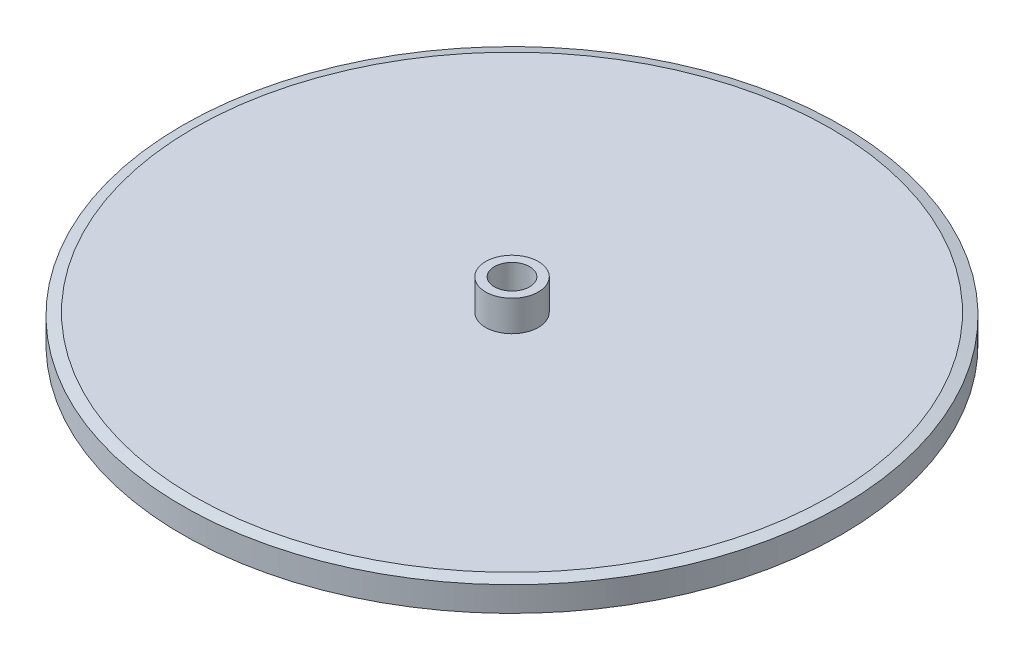
ISO-10303-21;
HEADER;
FILE_DESCRIPTION(('STEP AP214'),'2;1');
FILE_NAME('part.step','',(''),(''),'','','');
FILE_SCHEMA(('AUTOMOTIVE_DESIGN { 1 0 10303 214 1 1 1 1 }'));
ENDSEC;
DATA;
#1=APPLICATION_CONTEXT('core data for automotive mechanical design processes');
#2=APPLICATION_PROTOCOL_DEFINITION('international standard','automotive_design',2000,#1);
#3=PRODUCT_CONTEXT('',#1,'mechanical');
#4=PRODUCT('Part','Part','',(#3));
#5=PRODUCT_RELATED_PRODUCT_CATEGORY('part','',(#4));
#6=PRODUCT_DEFINITION_FORMATION('','',#4);
#7=PRODUCT_DEFINITION_CONTEXT('part definition',#1,'design');
#8=PRODUCT_DEFINITION('design','',#6,#7);
#9=PRODUCT_DEFINITION_SHAPE('','',#8);
#10=(LENGTH_UNIT() NAMED_UNIT(*) SI_UNIT(.MILLI.,.METRE.));
#11=(NAMED_UNIT(*) PLANE_ANGLE_UNIT() SI_UNIT($,.RADIAN.));
#12=(NAMED_UNIT(*) SI_UNIT($,.STERADIAN.) SOLID_ANGLE_UNIT());
#13=UNCERTAINTY_MEASURE_WITH_UNIT(LENGTH_MEASURE(1.E-05),#10,'distance_accuracy_value','');
#14=(GEOMETRIC_REPRESENTATION_CONTEXT(3) GLOBAL_UNCERTAINTY_ASSIGNED_CONTEXT((#13)) GLOBAL_UNIT_ASSIGNED_CONTEXT((#10,
#11,#12)) REPRESENTATION_CONTEXT('',''));
#15=CARTESIAN_POINT('',(0.,0.,0.));
#16=DIRECTION('',(0.,0.,1.));
#17=DIRECTION('',(1.,0.,0.));
#18=AXIS2_PLACEMENT_3D('',#15,#16,#17);
#19=CARTESIAN_POINT('',(0.,0.,0.));
#20=DIRECTION('',(0.,1.,0.));
#21=DIRECTION('',(-1.,0.,0.));
#22=AXIS2_PLACEMENT_3D('',#19,#20,#21);
#23=PLANE('',#22);
#24=CARTESIAN_POINT('',(0.,0.,0.));
#25=DIRECTION('',(0.,1.,0.));
#26=DIRECTION('',(-1.,0.,0.));
#27=AXIS2_PLACEMENT_3D('',#24,#25,#26);
#28=CIRCLE('',#27,36.25);
#29=CARTESIAN_POINT('',(-36.25,0.,0.));
#30=VERTEX_POINT('',#29);
#31=EDGE_CURVE('E10',#30,#30,#28,.F.);
#32=ORIENTED_EDGE('',*,*,#31,.T.);
#33=EDGE_LOOP('',(#32));
#34=FACE_BOUND('',#33,.T.);
#35=CARTESIAN_POINT('',(0.,0.,0.));
#36=DIRECTION('',(0.,-1.,0.));
#37=DIRECTION('',(0.,0.,-1.));
#38=AXIS2_PLACEMENT_3D('',#35,#36,#37);
#39=CIRCLE('',#38,2.);
#40=CARTESIAN_POINT('',(0.,0.,-2.));
#41=VERTEX_POINT('',#40);
#42=EDGE_CURVE('E65',#41,#41,#39,.T.);
#43=ORIENTED_EDGE('',*,*,#42,.F.);
#44=EDGE_LOOP('',(#43));
#45=FACE_BOUND('',#44,.T.);
#46=ADVANCED_FACE('F37',(#34,#45),#23,.F.);
#47=CARTESIAN_POINT('',(0.,7.,0.));
#48=DIRECTION('',(0.,1.,0.));
#49=DIRECTION('',(-1.,0.,0.));
#50=AXIS2_PLACEMENT_3D('',#47,#48,#49);
#51=CYLINDRICAL_SURFACE('',#50,37.5);
#52=CARTESIAN_POINT('',(0.,0.334936490538911,0.));
#53=DIRECTION('',(0.,1.,0.));
#54=DIRECTION('',(-1.,0.,0.));
#55=AXIS2_PLACEMENT_3D('',#52,#53,#54);
#56=CIRCLE('',#55,37.5);
#57=CARTESIAN_POINT('',(-37.5,0.334936490538911,0.));
#58=VERTEX_POINT('',#57);
#59=EDGE_CURVE('E45',#58,#58,#56,.T.);
#60=ORIENTED_EDGE('',*,*,#59,.T.);
#61=EDGE_LOOP('',(#60));
#62=FACE_BOUND('',#61,.T.);
#63=CARTESIAN_POINT('',(0.,3.16506350946109,0.));
#64=DIRECTION('',(0.,-1.,0.));
#65=DIRECTION('',(1.,0.,0.));
#66=AXIS2_PLACEMENT_3D('',#63,#64,#65);
#67=CIRCLE('',#66,37.5);
#68=CARTESIAN_POINT('',(37.5,3.16506350946109,0.));
#69=VERTEX_POINT('',#68);
#70=EDGE_CURVE('E49',#69,#69,#67,.T.);
#71=ORIENTED_EDGE('',*,*,#70,.T.);
#72=EDGE_LOOP('',(#71));
#73=FACE_BOUND('',#72,.T.);
#74=ADVANCED_FACE('F82',(#62,#73),#51,.T.);
#75=CARTESIAN_POINT('',(37.5,3.5,0.));
#76=DIRECTION('',(0.,-1.,0.));
#77=DIRECTION('',(1.,0.,0.));
#78=AXIS2_PLACEMENT_3D('',#75,#76,#77);
#79=PLANE('',#78);
#80=CARTESIAN_POINT('',(0.,3.5,0.));
#81=DIRECTION('',(0.,-1.,0.));
#82=DIRECTION('',(1.,0.,0.));
#83=AXIS2_PLACEMENT_3D('',#80,#81,#82);
#84=CIRCLE('',#83,36.25);
#85=CARTESIAN_POINT('',(36.25,3.5,0.));
#86=VERTEX_POINT('',#85);
#87=EDGE_CURVE('E53',#86,#86,#84,.F.);
#88=ORIENTED_EDGE('',*,*,#87,.T.);
#89=EDGE_LOOP('',(#88));
#90=FACE_BOUND('',#89,.T.);
#91=CARTESIAN_POINT('',(0.,3.5,0.));
#92=DIRECTION('',(0.,1.,0.));
#93=DIRECTION('',(-1.,0.,0.));
#94=AXIS2_PLACEMENT_3D('',#91,#92,#93);
#95=CIRCLE('',#94,3.);
#96=CARTESIAN_POINT('',(-3.,3.5,0.));
#97=VERTEX_POINT('',#96);
#98=EDGE_CURVE('E58',#97,#97,#95,.T.);
#99=ORIENTED_EDGE('',*,*,#98,.F.);
#100=EDGE_LOOP('',(#99));
#101=FACE_BOUND('',#100,.T.);
#102=ADVANCED_FACE('F87',(#90,#101),#79,.F.);
#103=CARTESIAN_POINT('',(0.,7.,0.));
#104=DIRECTION('',(0.,1.,0.));
#105=DIRECTION('',(-1.,0.,0.));
#106=AXIS2_PLACEMENT_3D('',#103,#104,#105);
#107=CYLINDRICAL_SURFACE('',#106,3.);
#108=CARTESIAN_POINT('',(0.,7.,0.));
#109=DIRECTION('',(0.,1.,0.));
#110=DIRECTION('',(-1.,0.,0.));
#111=AXIS2_PLACEMENT_3D('',#108,#109,#110);
#112=CIRCLE('',#111,3.);
#113=CARTESIAN_POINT('',(-3.,7.,0.));
#114=VERTEX_POINT('',#113);
#115=EDGE_CURVE('E61',#114,#114,#112,.T.);
#116=ORIENTED_EDGE('',*,*,#115,.F.);
#117=EDGE_LOOP('',(#116));
#118=FACE_BOUND('',#117,.T.);
#119=ORIENTED_EDGE('',*,*,#98,.T.);
#120=EDGE_LOOP('',(#119));
#121=FACE_BOUND('',#120,.T.);
#122=ADVANCED_FACE('F98',(#118,#121),#107,.T.);
#123=CARTESIAN_POINT('',(3.,7.,0.));
#124=DIRECTION('',(0.,-1.,0.));
#125=DIRECTION('',(1.,0.,0.));
#126=AXIS2_PLACEMENT_3D('',#123,#124,#125);
#127=PLANE('',#126);
#128=CARTESIAN_POINT('',(0.,7.,0.));
#129=DIRECTION('',(0.,-1.,0.));
#130=DIRECTION('',(0.,0.,-1.));
#131=AXIS2_PLACEMENT_3D('',#128,#129,#130);
#132=CIRCLE('',#131,2.);
#133=CARTESIAN_POINT('',(0.,7.,-2.));
#134=VERTEX_POINT('',#133);
#135=EDGE_CURVE('E64',#134,#134,#132,.T.);
#136=ORIENTED_EDGE('',*,*,#135,.T.);
#137=EDGE_LOOP('',(#136));
#138=FACE_BOUND('',#137,.T.);
#139=ORIENTED_EDGE('',*,*,#115,.T.);
#140=EDGE_LOOP('',(#139));
#141=FACE_BOUND('',#140,.T.);
#142=ADVANCED_FACE('F71',(#138,#141),#127,.F.);
#143=CARTESIAN_POINT('',(0.,3.5,0.));
#144=DIRECTION('',(0.,-1.,0.));
#145=DIRECTION('',(1.,0.,0.));
#146=AXIS2_PLACEMENT_3D('',#143,#144,#145);
#147=CONICAL_SURFACE('',#146,36.25,1.30899693899575);
#148=ORIENTED_EDGE('',*,*,#70,.F.);
#149=EDGE_LOOP('',(#148));
#150=FACE_BOUND('',#149,.T.);
#151=ORIENTED_EDGE('',*,*,#87,.F.);
#152=EDGE_LOOP('',(#151));
#153=FACE_BOUND('',#152,.T.);
#154=ADVANCED_FACE('F77',(#150,#153),#147,.T.);
#155=CARTESIAN_POINT('',(0.,7.,0.));
#156=DIRECTION('',(0.,-1.,0.));
#157=DIRECTION('',(0.,0.,-1.));
#158=AXIS2_PLACEMENT_3D('',#155,#156,#157);
#159=CYLINDRICAL_SURFACE('',#158,2.);
#160=ORIENTED_EDGE('',*,*,#135,.F.);
#161=EDGE_LOOP('',(#160));
#162=FACE_BOUND('',#161,.T.);
#163=ORIENTED_EDGE('',*,*,#42,.T.);
#164=EDGE_LOOP('',(#163));
#165=FACE_BOUND('',#164,.T.);
#166=ADVANCED_FACE('F74',(#162,#165),#159,.F.);
#167=CARTESIAN_POINT('',(0.,0.334936490538911,0.));
#168=DIRECTION('',(0.,1.,0.));
#169=DIRECTION('',(-1.,0.,0.));
#170=AXIS2_PLACEMENT_3D('',#167,#168,#169);
#171=CONICAL_SURFACE('',#170,37.5,1.30899693899575);
#172=ORIENTED_EDGE('',*,*,#31,.F.);
#173=EDGE_LOOP('',(#172));
#174=FACE_BOUND('',#173,.T.);
#175=ORIENTED_EDGE('',*,*,#59,.F.);
#176=EDGE_LOOP('',(#175));
#177=FACE_BOUND('',#176,.T.);
#178=ADVANCED_FACE('F40',(#174,#177),#171,.T.);
#179=CLOSED_SHELL('',(#46,#74,#102,#122,#142,#154,#166,#178));
#180=MANIFOLD_SOLID_BREP('B2',#179);
#181=ADVANCED_BREP_SHAPE_REPRESENTATION('',(#18,#180),#14);
#182=SHAPE_DEFINITION_REPRESENTATION(#9,#181);
ENDSEC;
END-ISO-10303-21;
